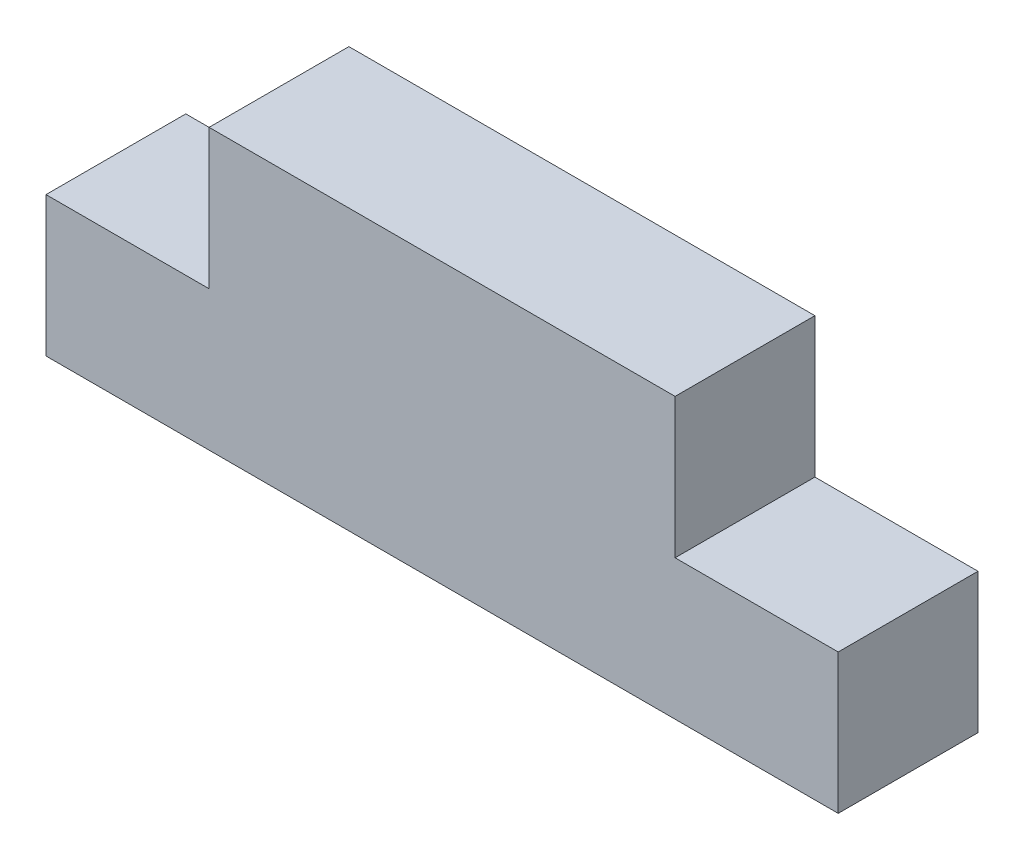
ISO-10303-21;
HEADER;
FILE_DESCRIPTION(('STEP AP214'),'2;1');
FILE_NAME('part.step','',(''),(''),'','','');
FILE_SCHEMA(('AUTOMOTIVE_DESIGN { 1 0 10303 214 1 1 1 1 }'));
ENDSEC;
DATA;
#1=APPLICATION_CONTEXT('core data for automotive mechanical design processes');
#2=APPLICATION_PROTOCOL_DEFINITION('international standard','automotive_design',2000,#1);
#3=PRODUCT_CONTEXT('',#1,'mechanical');
#4=PRODUCT('Part','Part','',(#3));
#5=PRODUCT_RELATED_PRODUCT_CATEGORY('part','',(#4));
#6=PRODUCT_DEFINITION_FORMATION('','',#4);
#7=PRODUCT_DEFINITION_CONTEXT('part definition',#1,'design');
#8=PRODUCT_DEFINITION('design','',#6,#7);
#9=PRODUCT_DEFINITION_SHAPE('','',#8);
#10=(LENGTH_UNIT() NAMED_UNIT(*) SI_UNIT(.MILLI.,.METRE.));
#11=(NAMED_UNIT(*) PLANE_ANGLE_UNIT() SI_UNIT($,.RADIAN.));
#12=(NAMED_UNIT(*) SI_UNIT($,.STERADIAN.) SOLID_ANGLE_UNIT());
#13=UNCERTAINTY_MEASURE_WITH_UNIT(LENGTH_MEASURE(1.E-05),#10,'distance_accuracy_value','');
#14=(GEOMETRIC_REPRESENTATION_CONTEXT(3) GLOBAL_UNCERTAINTY_ASSIGNED_CONTEXT((#13)) GLOBAL_UNIT_ASSIGNED_CONTEXT((#10,
#11,#12)) REPRESENTATION_CONTEXT('',''));
#15=CARTESIAN_POINT('',(0.,0.,0.));
#16=DIRECTION('',(0.,0.,1.));
#17=DIRECTION('',(1.,0.,0.));
#18=AXIS2_PLACEMENT_3D('',#15,#16,#17);
#19=CARTESIAN_POINT('',(0.,5.99999999999999,6.));
#20=DIRECTION('',(0.,-1.,0.));
#21=DIRECTION('',(1.,0.,0.));
#22=AXIS2_PLACEMENT_3D('',#19,#20,#21);
#23=PLANE('',#22);
#24=DIRECTION('',(-1.,0.,0.));
#25=VECTOR('',#24,1.);
#26=CARTESIAN_POINT('',(0.,5.99999999999999,0.));
#27=LINE('',#26,#25);
#28=CARTESIAN_POINT('',(34.,6.,0.));
#29=VERTEX_POINT('',#28);
#30=CARTESIAN_POINT('',(27.,6.,0.));
#31=VERTEX_POINT('',#30);
#32=EDGE_CURVE('E145',#29,#31,#27,.T.);
#33=ORIENTED_EDGE('',*,*,#32,.T.);
#34=DIRECTION('',(0.,0.,-1.));
#35=VECTOR('',#34,1.);
#36=CARTESIAN_POINT('',(27.,6.,6.));
#37=LINE('',#36,#35);
#38=CARTESIAN_POINT('',(27.,6.,6.));
#39=VERTEX_POINT('',#38);
#40=EDGE_CURVE('E11',#39,#31,#37,.T.);
#41=ORIENTED_EDGE('',*,*,#40,.F.);
#42=DIRECTION('',(-1.,0.,0.));
#43=VECTOR('',#42,1.);
#44=CARTESIAN_POINT('',(0.,5.99999999999999,6.));
#45=LINE('',#44,#43);
#46=CARTESIAN_POINT('',(34.,6.,6.));
#47=VERTEX_POINT('',#46);
#48=EDGE_CURVE('E171',#47,#39,#45,.T.);
#49=ORIENTED_EDGE('',*,*,#48,.F.);
#50=DIRECTION('',(0.,0.,-1.));
#51=VECTOR('',#50,1.);
#52=CARTESIAN_POINT('',(34.,6.,6.));
#53=LINE('',#52,#51);
#54=EDGE_CURVE('E144',#47,#29,#53,.T.);
#55=ORIENTED_EDGE('',*,*,#54,.T.);
#56=EDGE_LOOP('',(#33,#41,#49,#55));
#57=FACE_BOUND('',#56,.T.);
#58=ADVANCED_FACE('F41',(#57),#23,.F.);
#59=CARTESIAN_POINT('',(27.,0.,6.));
#60=DIRECTION('',(-1.,0.,0.));
#61=DIRECTION('',(0.,0.,1.));
#62=AXIS2_PLACEMENT_3D('',#59,#60,#61);
#63=PLANE('',#62);
#64=DIRECTION('',(0.,1.,0.));
#65=VECTOR('',#64,1.);
#66=CARTESIAN_POINT('',(27.,0.,0.));
#67=LINE('',#66,#65);
#68=CARTESIAN_POINT('',(27.,12.,0.));
#69=VERTEX_POINT('',#68);
#70=EDGE_CURVE('E149',#31,#69,#67,.T.);
#71=ORIENTED_EDGE('',*,*,#70,.T.);
#72=DIRECTION('',(0.,0.,-1.));
#73=VECTOR('',#72,1.);
#74=CARTESIAN_POINT('',(27.,12.,6.));
#75=LINE('',#74,#73);
#76=CARTESIAN_POINT('',(27.,12.,6.));
#77=VERTEX_POINT('',#76);
#78=EDGE_CURVE('E50',#77,#69,#75,.T.);
#79=ORIENTED_EDGE('',*,*,#78,.F.);
#80=DIRECTION('',(0.,1.,0.));
#81=VECTOR('',#80,1.);
#82=CARTESIAN_POINT('',(27.,0.,6.));
#83=LINE('',#82,#81);
#84=EDGE_CURVE('E100',#39,#77,#83,.T.);
#85=ORIENTED_EDGE('',*,*,#84,.F.);
#86=ORIENTED_EDGE('',*,*,#40,.T.);
#87=EDGE_LOOP('',(#71,#79,#85,#86));
#88=FACE_BOUND('',#87,.T.);
#89=ADVANCED_FACE('F190',(#88),#63,.F.);
#90=CARTESIAN_POINT('',(0.,12.,6.));
#91=DIRECTION('',(0.,1.,0.));
#92=DIRECTION('',(0.,0.,1.));
#93=AXIS2_PLACEMENT_3D('',#90,#91,#92);
#94=PLANE('',#93);
#95=DIRECTION('',(1.,0.,0.));
#96=VECTOR('',#95,1.);
#97=CARTESIAN_POINT('',(0.,12.,0.));
#98=LINE('',#97,#96);
#99=CARTESIAN_POINT('',(7.,12.,0.));
#100=VERTEX_POINT('',#99);
#101=EDGE_CURVE('E153',#100,#69,#98,.T.);
#102=ORIENTED_EDGE('',*,*,#101,.F.);
#103=DIRECTION('',(0.,0.,-1.));
#104=VECTOR('',#103,1.);
#105=CARTESIAN_POINT('',(7.,12.,6.));
#106=LINE('',#105,#104);
#107=CARTESIAN_POINT('',(7.,12.,6.));
#108=VERTEX_POINT('',#107);
#109=EDGE_CURVE('E181',#108,#100,#106,.T.);
#110=ORIENTED_EDGE('',*,*,#109,.F.);
#111=DIRECTION('',(1.,0.,0.));
#112=VECTOR('',#111,1.);
#113=CARTESIAN_POINT('',(0.,12.,6.));
#114=LINE('',#113,#112);
#115=EDGE_CURVE('E189',#108,#77,#114,.T.);
#116=ORIENTED_EDGE('',*,*,#115,.T.);
#117=ORIENTED_EDGE('',*,*,#78,.T.);
#118=EDGE_LOOP('',(#102,#110,#116,#117));
#119=FACE_BOUND('',#118,.T.);
#120=ADVANCED_FACE('F187',(#119),#94,.T.);
#121=CARTESIAN_POINT('',(7.,0.,6.));
#122=DIRECTION('',(-1.,0.,0.));
#123=DIRECTION('',(0.,0.,1.));
#124=AXIS2_PLACEMENT_3D('',#121,#122,#123);
#125=PLANE('',#124);
#126=DIRECTION('',(0.,1.,0.));
#127=VECTOR('',#126,1.);
#128=CARTESIAN_POINT('',(7.,0.,0.));
#129=LINE('',#128,#127);
#130=CARTESIAN_POINT('',(7.,6.,0.));
#131=VERTEX_POINT('',#130);
#132=EDGE_CURVE('E157',#131,#100,#129,.T.);
#133=ORIENTED_EDGE('',*,*,#132,.F.);
#134=DIRECTION('',(0.,0.,-1.));
#135=VECTOR('',#134,1.);
#136=CARTESIAN_POINT('',(7.,6.,6.));
#137=LINE('',#136,#135);
#138=CARTESIAN_POINT('',(7.,6.,6.));
#139=VERTEX_POINT('',#138);
#140=EDGE_CURVE('E178',#139,#131,#137,.T.);
#141=ORIENTED_EDGE('',*,*,#140,.F.);
#142=DIRECTION('',(0.,1.,0.));
#143=VECTOR('',#142,1.);
#144=CARTESIAN_POINT('',(7.,0.,6.));
#145=LINE('',#144,#143);
#146=EDGE_CURVE('E138',#139,#108,#145,.T.);
#147=ORIENTED_EDGE('',*,*,#146,.T.);
#148=ORIENTED_EDGE('',*,*,#109,.T.);
#149=EDGE_LOOP('',(#133,#141,#147,#148));
#150=FACE_BOUND('',#149,.T.);
#151=ADVANCED_FACE('F198',(#150),#125,.T.);
#152=CARTESIAN_POINT('',(0.,6.,6.));
#153=DIRECTION('',(0.,1.,0.));
#154=DIRECTION('',(0.,0.,1.));
#155=AXIS2_PLACEMENT_3D('',#152,#153,#154);
#156=PLANE('',#155);
#157=DIRECTION('',(1.,0.,0.));
#158=VECTOR('',#157,1.);
#159=CARTESIAN_POINT('',(0.,6.,0.));
#160=LINE('',#159,#158);
#161=CARTESIAN_POINT('',(0.,6.,0.));
#162=VERTEX_POINT('',#161);
#163=EDGE_CURVE('E161',#162,#131,#160,.T.);
#164=ORIENTED_EDGE('',*,*,#163,.F.);
#165=DIRECTION('',(0.,0.,-1.));
#166=VECTOR('',#165,1.);
#167=CARTESIAN_POINT('',(0.,6.,6.));
#168=LINE('',#167,#166);
#169=CARTESIAN_POINT('',(0.,6.,6.));
#170=VERTEX_POINT('',#169);
#171=EDGE_CURVE('E123',#170,#162,#168,.T.);
#172=ORIENTED_EDGE('',*,*,#171,.F.);
#173=DIRECTION('',(1.,0.,0.));
#174=VECTOR('',#173,1.);
#175=CARTESIAN_POINT('',(0.,6.,6.));
#176=LINE('',#175,#174);
#177=EDGE_CURVE('E134',#170,#139,#176,.T.);
#178=ORIENTED_EDGE('',*,*,#177,.T.);
#179=ORIENTED_EDGE('',*,*,#140,.T.);
#180=EDGE_LOOP('',(#164,#172,#178,#179));
#181=FACE_BOUND('',#180,.T.);
#182=ADVANCED_FACE('F230',(#181),#156,.T.);
#183=CARTESIAN_POINT('',(0.,0.,6.));
#184=DIRECTION('',(-1.,0.,0.));
#185=DIRECTION('',(0.,0.,1.));
#186=AXIS2_PLACEMENT_3D('',#183,#184,#185);
#187=PLANE('',#186);
#188=DIRECTION('',(0.,1.,0.));
#189=VECTOR('',#188,1.);
#190=CARTESIAN_POINT('',(0.,0.,0.));
#191=LINE('',#190,#189);
#192=CARTESIAN_POINT('',(0.,0.,0.));
#193=VERTEX_POINT('',#192);
#194=EDGE_CURVE('E121',#193,#162,#191,.T.);
#195=ORIENTED_EDGE('',*,*,#194,.F.);
#196=DIRECTION('',(0.,0.,-1.));
#197=VECTOR('',#196,1.);
#198=CARTESIAN_POINT('',(0.,0.,6.));
#199=LINE('',#198,#197);
#200=CARTESIAN_POINT('',(0.,0.,6.));
#201=VERTEX_POINT('',#200);
#202=EDGE_CURVE('E115',#201,#193,#199,.T.);
#203=ORIENTED_EDGE('',*,*,#202,.F.);
#204=DIRECTION('',(0.,1.,0.));
#205=VECTOR('',#204,1.);
#206=CARTESIAN_POINT('',(0.,0.,6.));
#207=LINE('',#206,#205);
#208=EDGE_CURVE('E119',#201,#170,#207,.T.);
#209=ORIENTED_EDGE('',*,*,#208,.T.);
#210=ORIENTED_EDGE('',*,*,#171,.T.);
#211=EDGE_LOOP('',(#195,#203,#209,#210));
#212=FACE_BOUND('',#211,.T.);
#213=ADVANCED_FACE('F117',(#212),#187,.T.);
#214=CARTESIAN_POINT('',(0.,0.,6.));
#215=DIRECTION('',(0.,1.,0.));
#216=DIRECTION('',(0.,0.,1.));
#217=AXIS2_PLACEMENT_3D('',#214,#215,#216);
#218=PLANE('',#217);
#219=DIRECTION('',(1.,0.,0.));
#220=VECTOR('',#219,1.);
#221=CARTESIAN_POINT('',(0.,0.,0.));
#222=LINE('',#221,#220);
#223=CARTESIAN_POINT('',(34.,0.,0.));
#224=VERTEX_POINT('',#223);
#225=EDGE_CURVE('E86',#193,#224,#222,.T.);
#226=ORIENTED_EDGE('',*,*,#225,.T.);
#227=DIRECTION('',(0.,0.,-1.));
#228=VECTOR('',#227,1.);
#229=CARTESIAN_POINT('',(34.,0.,6.));
#230=LINE('',#229,#228);
#231=CARTESIAN_POINT('',(34.,0.,6.));
#232=VERTEX_POINT('',#231);
#233=EDGE_CURVE('E124',#232,#224,#230,.T.);
#234=ORIENTED_EDGE('',*,*,#233,.F.);
#235=DIRECTION('',(1.,0.,0.));
#236=VECTOR('',#235,1.);
#237=CARTESIAN_POINT('',(0.,0.,6.));
#238=LINE('',#237,#236);
#239=EDGE_CURVE('E126',#201,#232,#238,.T.);
#240=ORIENTED_EDGE('',*,*,#239,.F.);
#241=ORIENTED_EDGE('',*,*,#202,.T.);
#242=EDGE_LOOP('',(#226,#234,#240,#241));
#243=FACE_BOUND('',#242,.T.);
#244=ADVANCED_FACE('F127',(#243),#218,.F.);
#245=CARTESIAN_POINT('',(34.,0.,6.));
#246=DIRECTION('',(-1.,0.,0.));
#247=DIRECTION('',(0.,0.,1.));
#248=AXIS2_PLACEMENT_3D('',#245,#246,#247);
#249=PLANE('',#248);
#250=DIRECTION('',(0.,1.,0.));
#251=VECTOR('',#250,1.);
#252=CARTESIAN_POINT('',(34.,0.,0.));
#253=LINE('',#252,#251);
#254=EDGE_CURVE('E92',#224,#29,#253,.T.);
#255=ORIENTED_EDGE('',*,*,#254,.T.);
#256=ORIENTED_EDGE('',*,*,#54,.F.);
#257=DIRECTION('',(0.,1.,0.));
#258=VECTOR('',#257,1.);
#259=CARTESIAN_POINT('',(34.,0.,6.));
#260=LINE('',#259,#258);
#261=EDGE_CURVE('E58',#232,#47,#260,.T.);
#262=ORIENTED_EDGE('',*,*,#261,.F.);
#263=ORIENTED_EDGE('',*,*,#233,.T.);
#264=EDGE_LOOP('',(#255,#256,#262,#263));
#265=FACE_BOUND('',#264,.T.);
#266=ADVANCED_FACE('F209',(#265),#249,.F.);
#267=CARTESIAN_POINT('',(0.,0.,6.));
#268=DIRECTION('',(0.,0.,1.));
#269=DIRECTION('',(1.,0.,0.));
#270=AXIS2_PLACEMENT_3D('',#267,#268,#269);
#271=PLANE('',#270);
#272=ORIENTED_EDGE('',*,*,#48,.T.);
#273=ORIENTED_EDGE('',*,*,#84,.T.);
#274=ORIENTED_EDGE('',*,*,#115,.F.);
#275=ORIENTED_EDGE('',*,*,#146,.F.);
#276=ORIENTED_EDGE('',*,*,#177,.F.);
#277=ORIENTED_EDGE('',*,*,#208,.F.);
#278=ORIENTED_EDGE('',*,*,#239,.T.);
#279=ORIENTED_EDGE('',*,*,#261,.T.);
#280=EDGE_LOOP('',(#272,#273,#274,#275,#276,#277,#278,#279));
#281=FACE_BOUND('',#280,.T.);
#282=ADVANCED_FACE('F131',(#281),#271,.T.);
#283=CARTESIAN_POINT('',(0.,0.,0.));
#284=DIRECTION('',(0.,0.,1.));
#285=DIRECTION('',(1.,0.,0.));
#286=AXIS2_PLACEMENT_3D('',#283,#284,#285);
#287=PLANE('',#286);
#288=ORIENTED_EDGE('',*,*,#32,.F.);
#289=ORIENTED_EDGE('',*,*,#254,.F.);
#290=ORIENTED_EDGE('',*,*,#225,.F.);
#291=ORIENTED_EDGE('',*,*,#194,.T.);
#292=ORIENTED_EDGE('',*,*,#163,.T.);
#293=ORIENTED_EDGE('',*,*,#132,.T.);
#294=ORIENTED_EDGE('',*,*,#101,.T.);
#295=ORIENTED_EDGE('',*,*,#70,.F.);
#296=EDGE_LOOP('',(#288,#289,#290,#291,#292,#293,#294,#295));
#297=FACE_BOUND('',#296,.T.);
#298=ADVANCED_FACE('F194',(#297),#287,.F.);
#299=CLOSED_SHELL('',(#58,#89,#120,#151,#182,#213,#244,#266,#282,#298));
#300=MANIFOLD_SOLID_BREP('B2',#299);
#301=ADVANCED_BREP_SHAPE_REPRESENTATION('',(#18,#300),#14);
#302=SHAPE_DEFINITION_REPRESENTATION(#9,#301);
ENDSEC;
END-ISO-10303-21;
